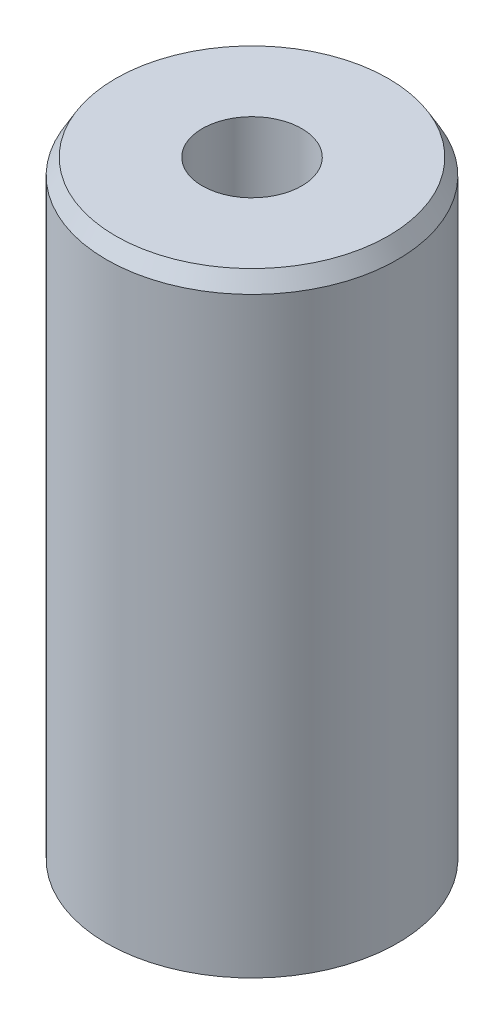
ISO-10303-21;
HEADER;
FILE_DESCRIPTION(('STEP AP214'),'2;1');
FILE_NAME('part.step','',(''),(''),'','','');
FILE_SCHEMA(('AUTOMOTIVE_DESIGN { 1 0 10303 214 1 1 1 1 }'));
ENDSEC;
DATA;
#1=APPLICATION_CONTEXT('core data for automotive mechanical design processes');
#2=APPLICATION_PROTOCOL_DEFINITION('international standard','automotive_design',2000,#1);
#3=PRODUCT_CONTEXT('',#1,'mechanical');
#4=PRODUCT('Part','Part','',(#3));
#5=PRODUCT_RELATED_PRODUCT_CATEGORY('part','',(#4));
#6=PRODUCT_DEFINITION_FORMATION('','',#4);
#7=PRODUCT_DEFINITION_CONTEXT('part definition',#1,'design');
#8=PRODUCT_DEFINITION('design','',#6,#7);
#9=PRODUCT_DEFINITION_SHAPE('','',#8);
#10=(LENGTH_UNIT() NAMED_UNIT(*) SI_UNIT(.MILLI.,.METRE.));
#11=(NAMED_UNIT(*) PLANE_ANGLE_UNIT() SI_UNIT($,.RADIAN.));
#12=(NAMED_UNIT(*) SI_UNIT($,.STERADIAN.) SOLID_ANGLE_UNIT());
#13=UNCERTAINTY_MEASURE_WITH_UNIT(LENGTH_MEASURE(1.E-05),#10,'distance_accuracy_value','');
#14=(GEOMETRIC_REPRESENTATION_CONTEXT(3) GLOBAL_UNCERTAINTY_ASSIGNED_CONTEXT((#13)) GLOBAL_UNIT_ASSIGNED_CONTEXT((#10,
#11,#12)) REPRESENTATION_CONTEXT('',''));
#15=CARTESIAN_POINT('',(0.,0.,0.));
#16=DIRECTION('',(0.,0.,1.));
#17=DIRECTION('',(1.,0.,0.));
#18=AXIS2_PLACEMENT_3D('',#15,#16,#17);
#19=CARTESIAN_POINT('',(0.,180.160392053301,0.));
#20=DIRECTION('',(0.,-1.,0.));
#21=DIRECTION('',(0.,0.,-1.));
#22=AXIS2_PLACEMENT_3D('',#19,#20,#21);
#23=CYLINDRICAL_SURFACE('',#22,42.5);
#24=CARTESIAN_POINT('',(0.,175.515751629581,0.));
#25=DIRECTION('',(0.,1.,0.));
#26=DIRECTION('',(0.,0.,1.));
#27=AXIS2_PLACEMENT_3D('',#24,#25,#26);
#28=CIRCLE('',#27,42.5);
#29=CARTESIAN_POINT('',(0.,175.515751629581,42.5));
#30=VERTEX_POINT('',#29);
#31=EDGE_CURVE('E50',#30,#30,#28,.F.);
#32=ORIENTED_EDGE('',*,*,#31,.T.);
#33=EDGE_LOOP('',(#32));
#34=FACE_BOUND('',#33,.T.);
#35=CARTESIAN_POINT('',(0.,2.68158439892374,0.));
#36=DIRECTION('',(0.,1.,0.));
#37=DIRECTION('',(0.,0.,1.));
#38=AXIS2_PLACEMENT_3D('',#35,#36,#37);
#39=CIRCLE('',#38,42.5);
#40=CARTESIAN_POINT('',(0.,2.68158439892374,42.5));
#41=VERTEX_POINT('',#40);
#42=EDGE_CURVE('E51',#41,#41,#39,.T.);
#43=ORIENTED_EDGE('',*,*,#42,.T.);
#44=EDGE_LOOP('',(#43));
#45=FACE_BOUND('',#44,.T.);
#46=ADVANCED_FACE('F39',(#34,#45),#23,.T.);
#47=CARTESIAN_POINT('',(0.,180.160392053301,0.));
#48=DIRECTION('',(0.,1.,0.));
#49=DIRECTION('',(0.,0.,1.));
#50=AXIS2_PLACEMENT_3D('',#47,#48,#49);
#51=PLANE('',#50);
#52=CARTESIAN_POINT('',(0.,180.160392053301,0.));
#53=DIRECTION('',(0.,1.,0.));
#54=DIRECTION('',(0.,0.,1.));
#55=AXIS2_PLACEMENT_3D('',#52,#53,#54);
#56=CIRCLE('',#55,39.8184156010763);
#57=CARTESIAN_POINT('',(0.,180.160392053301,39.8184156010763));
#58=VERTEX_POINT('',#57);
#59=EDGE_CURVE('E54',#58,#58,#56,.T.);
#60=ORIENTED_EDGE('',*,*,#59,.T.);
#61=EDGE_LOOP('',(#60));
#62=FACE_BOUND('',#61,.T.);
#63=CARTESIAN_POINT('',(0.,180.160392053301,0.));
#64=DIRECTION('',(0.,1.,0.));
#65=DIRECTION('',(0.,0.,1.));
#66=AXIS2_PLACEMENT_3D('',#63,#64,#65);
#67=CIRCLE('',#66,14.5169668484841);
#68=CARTESIAN_POINT('',(0.,180.160392053301,14.5169668484841));
#69=VERTEX_POINT('',#68);
#70=EDGE_CURVE('E58',#69,#69,#67,.T.);
#71=ORIENTED_EDGE('',*,*,#70,.F.);
#72=EDGE_LOOP('',(#71));
#73=FACE_BOUND('',#72,.T.);
#74=ADVANCED_FACE('F69',(#62,#73),#51,.T.);
#75=CARTESIAN_POINT('',(0.,0.,0.));
#76=DIRECTION('',(0.,1.,0.));
#77=DIRECTION('',(0.,0.,1.));
#78=AXIS2_PLACEMENT_3D('',#75,#76,#77);
#79=PLANE('',#78);
#80=CARTESIAN_POINT('',(0.,0.,0.));
#81=DIRECTION('',(0.,1.,0.));
#82=DIRECTION('',(0.,0.,1.));
#83=AXIS2_PLACEMENT_3D('',#80,#81,#82);
#84=CIRCLE('',#83,37.85535957628);
#85=CARTESIAN_POINT('',(0.,0.,37.85535957628));
#86=VERTEX_POINT('',#85);
#87=EDGE_CURVE('E10',#86,#86,#84,.F.);
#88=ORIENTED_EDGE('',*,*,#87,.T.);
#89=EDGE_LOOP('',(#88));
#90=FACE_BOUND('',#89,.T.);
#91=CARTESIAN_POINT('',(0.,0.,0.));
#92=DIRECTION('',(0.,1.,0.));
#93=DIRECTION('',(0.,0.,1.));
#94=AXIS2_PLACEMENT_3D('',#91,#92,#93);
#95=CIRCLE('',#94,14.5169668484841);
#96=CARTESIAN_POINT('',(0.,0.,14.5169668484841));
#97=VERTEX_POINT('',#96);
#98=EDGE_CURVE('E63',#97,#97,#95,.T.);
#99=ORIENTED_EDGE('',*,*,#98,.T.);
#100=EDGE_LOOP('',(#99));
#101=FACE_BOUND('',#100,.T.);
#102=ADVANCED_FACE('F75',(#90,#101),#79,.F.);
#103=CARTESIAN_POINT('',(0.,180.160392053301,0.));
#104=DIRECTION('',(0.,-1.,0.));
#105=DIRECTION('',(0.,0.,-1.));
#106=AXIS2_PLACEMENT_3D('',#103,#104,#105);
#107=CYLINDRICAL_SURFACE('',#106,14.5169668484841);
#108=ORIENTED_EDGE('',*,*,#70,.T.);
#109=EDGE_LOOP('',(#108));
#110=FACE_BOUND('',#109,.T.);
#111=ORIENTED_EDGE('',*,*,#98,.F.);
#112=EDGE_LOOP('',(#111));
#113=FACE_BOUND('',#112,.T.);
#114=ADVANCED_FACE('F70',(#110,#113),#107,.F.);
#115=CARTESIAN_POINT('',(0.,180.160392053301,0.));
#116=DIRECTION('',(0.,-1.,0.));
#117=DIRECTION('',(0.,0.,-1.));
#118=AXIS2_PLACEMENT_3D('',#115,#116,#117);
#119=CONICAL_SURFACE('',#118,39.8184156010763,0.523598775598295);
#120=ORIENTED_EDGE('',*,*,#31,.F.);
#121=EDGE_LOOP('',(#120));
#122=FACE_BOUND('',#121,.T.);
#123=ORIENTED_EDGE('',*,*,#59,.F.);
#124=EDGE_LOOP('',(#123));
#125=FACE_BOUND('',#124,.T.);
#126=ADVANCED_FACE('F81',(#122,#125),#119,.T.);
#127=CARTESIAN_POINT('',(0.,2.68158439892374,0.));
#128=DIRECTION('',(0.,1.,0.));
#129=DIRECTION('',(0.,0.,1.));
#130=AXIS2_PLACEMENT_3D('',#127,#128,#129);
#131=CONICAL_SURFACE('',#130,42.5,1.0471975511966);
#132=ORIENTED_EDGE('',*,*,#87,.F.);
#133=EDGE_LOOP('',(#132));
#134=FACE_BOUND('',#133,.T.);
#135=ORIENTED_EDGE('',*,*,#42,.F.);
#136=EDGE_LOOP('',(#135));
#137=FACE_BOUND('',#136,.T.);
#138=ADVANCED_FACE('F45',(#134,#137),#131,.T.);
#139=CLOSED_SHELL('',(#46,#74,#102,#114,#126,#138));
#140=MANIFOLD_SOLID_BREP('B2',#139);
#141=ADVANCED_BREP_SHAPE_REPRESENTATION('',(#18,#140),#14);
#142=SHAPE_DEFINITION_REPRESENTATION(#9,#141);
ENDSEC;
END-ISO-10303-21;
